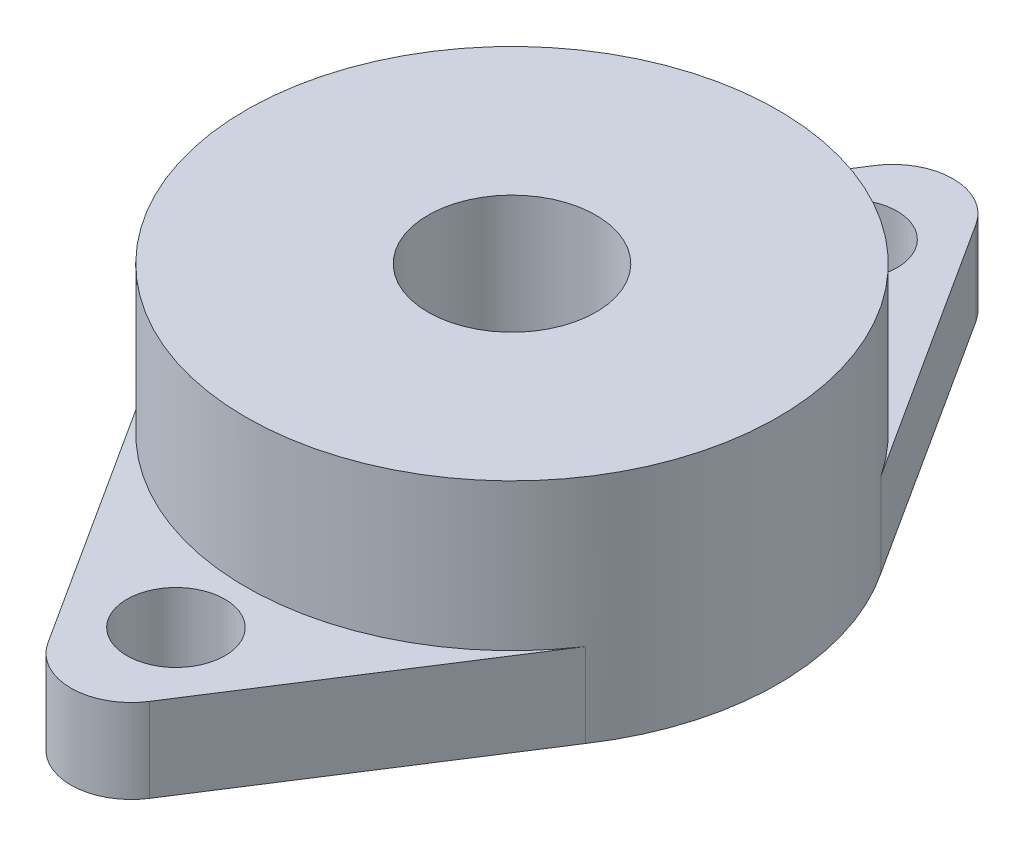
ISO-10303-21;
HEADER;
FILE_DESCRIPTION(('STEP AP214'),'2;1');
FILE_NAME('part.step','',(''),(''),'','','');
FILE_SCHEMA(('AUTOMOTIVE_DESIGN { 1 0 10303 214 1 1 1 1 }'));
ENDSEC;
DATA;
#1=APPLICATION_CONTEXT('core data for automotive mechanical design processes');
#2=APPLICATION_PROTOCOL_DEFINITION('international standard','automotive_design',2000,#1);
#3=PRODUCT_CONTEXT('',#1,'mechanical');
#4=PRODUCT('Part','Part','',(#3));
#5=PRODUCT_RELATED_PRODUCT_CATEGORY('part','',(#4));
#6=PRODUCT_DEFINITION_FORMATION('','',#4);
#7=PRODUCT_DEFINITION_CONTEXT('part definition',#1,'design');
#8=PRODUCT_DEFINITION('design','',#6,#7);
#9=PRODUCT_DEFINITION_SHAPE('','',#8);
#10=(LENGTH_UNIT() NAMED_UNIT(*) SI_UNIT(.MILLI.,.METRE.));
#11=(NAMED_UNIT(*) PLANE_ANGLE_UNIT() SI_UNIT($,.RADIAN.));
#12=(NAMED_UNIT(*) SI_UNIT($,.STERADIAN.) SOLID_ANGLE_UNIT());
#13=UNCERTAINTY_MEASURE_WITH_UNIT(LENGTH_MEASURE(1.E-05),#10,'distance_accuracy_value','');
#14=(GEOMETRIC_REPRESENTATION_CONTEXT(3) GLOBAL_UNCERTAINTY_ASSIGNED_CONTEXT((#13)) GLOBAL_UNIT_ASSIGNED_CONTEXT((#10,
#11,#12)) REPRESENTATION_CONTEXT('',''));
#15=CARTESIAN_POINT('',(0.,0.,0.));
#16=DIRECTION('',(0.,0.,1.));
#17=DIRECTION('',(1.,0.,0.));
#18=AXIS2_PLACEMENT_3D('',#15,#16,#17);
#19=CARTESIAN_POINT('',(0.,16.5,0.));
#20=DIRECTION('',(0.,-1.,0.));
#21=DIRECTION('',(0.,0.,-1.));
#22=AXIS2_PLACEMENT_3D('',#19,#20,#21);
#23=CYLINDRICAL_SURFACE('',#22,19.);
#24=CARTESIAN_POINT('',(0.,6.,0.));
#25=DIRECTION('',(0.,1.,0.));
#26=DIRECTION('',(0.,0.,1.));
#27=AXIS2_PLACEMENT_3D('',#24,#25,#26);
#28=CIRCLE('',#27,19.);
#29=CARTESIAN_POINT('',(-15.8019258783948,6.,10.5498406875989));
#30=VERTEX_POINT('',#29);
#31=CARTESIAN_POINT('',(15.801925878395,6.,10.5498406875986));
#32=VERTEX_POINT('',#31);
#33=EDGE_CURVE('E11',#30,#32,#28,.T.);
#34=ORIENTED_EDGE('',*,*,#33,.T.);
#35=DIRECTION('',(0.,-1.,0.));
#36=VECTOR('',#35,1.);
#37=CARTESIAN_POINT('',(15.8019258783948,6.,10.5498406875988));
#38=LINE('',#37,#36);
#39=CARTESIAN_POINT('',(15.8019258783948,0.,10.5498406875988));
#40=VERTEX_POINT('',#39);
#41=EDGE_CURVE('E131',#32,#40,#38,.T.);
#42=ORIENTED_EDGE('',*,*,#41,.T.);
#43=CARTESIAN_POINT('',(0.,0.,0.));
#44=DIRECTION('',(0.,1.,0.));
#45=DIRECTION('',(0.,0.,1.));
#46=AXIS2_PLACEMENT_3D('',#43,#44,#45);
#47=CIRCLE('',#46,19.);
#48=CARTESIAN_POINT('',(15.8019258783948,0.,-10.5498406875988));
#49=VERTEX_POINT('',#48);
#50=EDGE_CURVE('E173',#40,#49,#47,.T.);
#51=ORIENTED_EDGE('',*,*,#50,.T.);
#52=DIRECTION('',(0.,-1.,0.));
#53=VECTOR('',#52,1.);
#54=CARTESIAN_POINT('',(15.8019258783948,6.,-10.5498406875988));
#55=LINE('',#54,#53);
#56=CARTESIAN_POINT('',(15.8019258783948,6.,-10.5498406875988));
#57=VERTEX_POINT('',#56);
#58=EDGE_CURVE('E155',#57,#49,#55,.T.);
#59=ORIENTED_EDGE('',*,*,#58,.F.);
#60=CARTESIAN_POINT('',(0.,6.,0.));
#61=DIRECTION('',(0.,1.,0.));
#62=DIRECTION('',(0.,0.,1.));
#63=AXIS2_PLACEMENT_3D('',#60,#61,#62);
#64=CIRCLE('',#63,19.);
#65=CARTESIAN_POINT('',(-15.8019258783948,6.,-10.5498406875988));
#66=VERTEX_POINT('',#65);
#67=EDGE_CURVE('E44',#57,#66,#64,.T.);
#68=ORIENTED_EDGE('',*,*,#67,.T.);
#69=DIRECTION('',(0.,-1.,0.));
#70=VECTOR('',#69,1.);
#71=CARTESIAN_POINT('',(-15.8019258783948,6.,-10.5498406875988));
#72=LINE('',#71,#70);
#73=CARTESIAN_POINT('',(-15.8019258783948,0.,-10.5498406875988));
#74=VERTEX_POINT('',#73);
#75=EDGE_CURVE('E165',#66,#74,#72,.T.);
#76=ORIENTED_EDGE('',*,*,#75,.T.);
#77=CARTESIAN_POINT('',(-15.801925878395,0.,10.5498406875986));
#78=VERTEX_POINT('',#77);
#79=EDGE_CURVE('E177',#74,#78,#47,.T.);
#80=ORIENTED_EDGE('',*,*,#79,.T.);
#81=DIRECTION('',(0.,-1.,0.));
#82=VECTOR('',#81,1.);
#83=CARTESIAN_POINT('',(-15.8019258783948,6.,10.5498406875988));
#84=LINE('',#83,#82);
#85=EDGE_CURVE('E54',#30,#78,#84,.T.);
#86=ORIENTED_EDGE('',*,*,#85,.F.);
#87=EDGE_LOOP('',(#34,#42,#51,#59,#68,#76,#80,#86));
#88=FACE_BOUND('',#87,.T.);
#89=CARTESIAN_POINT('',(0.,16.5,0.));
#90=DIRECTION('',(0.,1.,0.));
#91=DIRECTION('',(0.,0.,1.));
#92=AXIS2_PLACEMENT_3D('',#89,#90,#91);
#93=CIRCLE('',#92,19.);
#94=CARTESIAN_POINT('',(0.,16.5,19.));
#95=VERTEX_POINT('',#94);
#96=EDGE_CURVE('E174',#95,#95,#93,.T.);
#97=ORIENTED_EDGE('',*,*,#96,.F.);
#98=EDGE_LOOP('',(#97));
#99=FACE_BOUND('',#98,.T.);
#100=ADVANCED_FACE('F37',(#88,#99),#23,.T.);
#101=CARTESIAN_POINT('',(0.,16.5,0.));
#102=DIRECTION('',(0.,1.,0.));
#103=DIRECTION('',(0.,0.,1.));
#104=AXIS2_PLACEMENT_3D('',#101,#102,#103);
#105=PLANE('',#104);
#106=CARTESIAN_POINT('',(0.,16.5,0.));
#107=DIRECTION('',(0.,1.,0.));
#108=DIRECTION('',(0.,0.,1.));
#109=AXIS2_PLACEMENT_3D('',#106,#107,#108);
#110=CIRCLE('',#109,6.);
#111=CARTESIAN_POINT('',(0.,16.5,6.));
#112=VERTEX_POINT('',#111);
#113=EDGE_CURVE('E137',#112,#112,#110,.T.);
#114=ORIENTED_EDGE('',*,*,#113,.F.);
#115=EDGE_LOOP('',(#114));
#116=FACE_BOUND('',#115,.T.);
#117=ORIENTED_EDGE('',*,*,#96,.T.);
#118=EDGE_LOOP('',(#117));
#119=FACE_BOUND('',#118,.T.);
#120=ADVANCED_FACE('F211',(#116,#119),#105,.T.);
#121=CARTESIAN_POINT('',(0.,0.,0.));
#122=DIRECTION('',(0.,1.,0.));
#123=DIRECTION('',(0.,0.,1.));
#124=AXIS2_PLACEMENT_3D('',#121,#122,#123);
#125=PLANE('',#124);
#126=CARTESIAN_POINT('',(0.,0.,24.));
#127=DIRECTION('',(0.,-1.,0.));
#128=DIRECTION('',(0.,0.,-1.));
#129=AXIS2_PLACEMENT_3D('',#126,#127,#128);
#130=CIRCLE('',#129,3.5);
#131=CARTESIAN_POINT('',(0.,0.,20.5));
#132=VERTEX_POINT('',#131);
#133=EDGE_CURVE('E126',#132,#132,#130,.T.);
#134=ORIENTED_EDGE('',*,*,#133,.F.);
#135=EDGE_LOOP('',(#134));
#136=FACE_BOUND('',#135,.T.);
#137=CARTESIAN_POINT('',(0.,0.,-24.));
#138=DIRECTION('',(0.,1.,0.));
#139=DIRECTION('',(0.,0.,1.));
#140=AXIS2_PLACEMENT_3D('',#137,#138,#139);
#141=CIRCLE('',#140,3.5);
#142=CARTESIAN_POINT('',(0.,0.,-20.5));
#143=VERTEX_POINT('',#142);
#144=EDGE_CURVE('E134',#143,#143,#141,.T.);
#145=ORIENTED_EDGE('',*,*,#144,.T.);
#146=EDGE_LOOP('',(#145));
#147=FACE_BOUND('',#146,.T.);
#148=CARTESIAN_POINT('',(0.,0.,0.));
#149=DIRECTION('',(0.,1.,0.));
#150=DIRECTION('',(0.,0.,1.));
#151=AXIS2_PLACEMENT_3D('',#148,#149,#150);
#152=CIRCLE('',#151,6.);
#153=CARTESIAN_POINT('',(0.,0.,6.));
#154=VERTEX_POINT('',#153);
#155=EDGE_CURVE('E140',#154,#154,#152,.T.);
#156=ORIENTED_EDGE('',*,*,#155,.T.);
#157=EDGE_LOOP('',(#156));
#158=FACE_BOUND('',#157,.T.);
#159=ORIENTED_EDGE('',*,*,#50,.F.);
#160=DIRECTION('',(-0.540306309271465,0.,0.841468414238733));
#161=VECTOR('',#160,1.);
#162=CARTESIAN_POINT('',(15.9853476935785,0.,10.2641811250305));
#163=LINE('',#162,#161);
#164=CARTESIAN_POINT('',(3.61947725031331,0.,29.5226817459218));
#165=VERTEX_POINT('',#164);
#166=EDGE_CURVE('E123',#40,#165,#163,.T.);
#167=ORIENTED_EDGE('',*,*,#166,.T.);
#168=CARTESIAN_POINT('',(0.,0.,27.1986178101672));
#169=DIRECTION('',(0.,-1.,0.));
#170=DIRECTION('',(0.,0.,-1.));
#171=AXIS2_PLACEMENT_3D('',#168,#169,#170);
#172=CIRCLE('',#171,4.30138218983278);
#173=CARTESIAN_POINT('',(-3.61947725031332,0.,29.5226817459218));
#174=VERTEX_POINT('',#173);
#175=EDGE_CURVE('E128',#165,#174,#172,.T.);
#176=ORIENTED_EDGE('',*,*,#175,.T.);
#177=DIRECTION('',(0.540306309271465,0.,0.841468414238733));
#178=VECTOR('',#177,1.);
#179=CARTESIAN_POINT('',(-15.9853476935785,0.,10.2641811250305));
#180=LINE('',#179,#178);
#181=EDGE_CURVE('E111',#78,#174,#180,.T.);
#182=ORIENTED_EDGE('',*,*,#181,.F.);
#183=ORIENTED_EDGE('',*,*,#79,.F.);
#184=DIRECTION('',(0.540306309271465,0.,-0.841468414238733));
#185=VECTOR('',#184,1.);
#186=CARTESIAN_POINT('',(-15.9853476935785,0.,-10.2641811250305));
#187=LINE('',#186,#185);
#188=CARTESIAN_POINT('',(-3.61947725031332,0.,-29.5226817459218));
#189=VERTEX_POINT('',#188);
#190=EDGE_CURVE('E150',#74,#189,#187,.T.);
#191=ORIENTED_EDGE('',*,*,#190,.T.);
#192=CARTESIAN_POINT('',(0.,0.,-27.1986178101672));
#193=DIRECTION('',(0.,1.,0.));
#194=DIRECTION('',(0.,0.,1.));
#195=AXIS2_PLACEMENT_3D('',#192,#193,#194);
#196=CIRCLE('',#195,4.30138218983278);
#197=CARTESIAN_POINT('',(3.61947725031331,0.,-29.5226817459218));
#198=VERTEX_POINT('',#197);
#199=EDGE_CURVE('E158',#198,#189,#196,.T.);
#200=ORIENTED_EDGE('',*,*,#199,.F.);
#201=DIRECTION('',(-0.540306309271465,0.,-0.841468414238733));
#202=VECTOR('',#201,1.);
#203=CARTESIAN_POINT('',(15.9853476935785,0.,-10.2641811250305));
#204=LINE('',#203,#202);
#205=EDGE_CURVE('E143',#49,#198,#204,.T.);
#206=ORIENTED_EDGE('',*,*,#205,.F.);
#207=EDGE_LOOP('',(#159,#167,#176,#182,#183,#191,#200,#206));
#208=FACE_BOUND('',#207,.T.);
#209=ADVANCED_FACE('F194',(#136,#147,#158,#208),#125,.F.);
#210=CARTESIAN_POINT('',(15.9853476935785,6.,-10.2641811250305));
#211=DIRECTION('',(-0.841468414238733,0.,0.540306309271465));
#212=DIRECTION('',(0.540306309271465,0.,0.841468414238733));
#213=AXIS2_PLACEMENT_3D('',#210,#211,#212);
#214=PLANE('',#213);
#215=ORIENTED_EDGE('',*,*,#205,.T.);
#216=DIRECTION('',(0.,-1.,0.));
#217=VECTOR('',#216,1.);
#218=CARTESIAN_POINT('',(3.61947725031331,6.,-29.5226817459218));
#219=LINE('',#218,#217);
#220=CARTESIAN_POINT('',(3.61947725031331,6.,-29.5226817459218));
#221=VERTEX_POINT('',#220);
#222=EDGE_CURVE('E170',#221,#198,#219,.T.);
#223=ORIENTED_EDGE('',*,*,#222,.F.);
#224=DIRECTION('',(-0.540306309271465,0.,-0.841468414238733));
#225=VECTOR('',#224,1.);
#226=CARTESIAN_POINT('',(15.9853476935785,6.,-10.2641811250305));
#227=LINE('',#226,#225);
#228=EDGE_CURVE('E146',#57,#221,#227,.T.);
#229=ORIENTED_EDGE('',*,*,#228,.F.);
#230=ORIENTED_EDGE('',*,*,#58,.T.);
#231=EDGE_LOOP('',(#215,#223,#229,#230));
#232=FACE_BOUND('',#231,.T.);
#233=ADVANCED_FACE('F210',(#232),#214,.F.);
#234=CARTESIAN_POINT('',(0.,6.,-27.1986178101672));
#235=DIRECTION('',(0.,-1.,0.));
#236=DIRECTION('',(0.,0.,-1.));
#237=AXIS2_PLACEMENT_3D('',#234,#235,#236);
#238=CYLINDRICAL_SURFACE('',#237,4.30138218983278);
#239=ORIENTED_EDGE('',*,*,#199,.T.);
#240=DIRECTION('',(0.,-1.,0.));
#241=VECTOR('',#240,1.);
#242=CARTESIAN_POINT('',(-3.61947725031332,6.,-29.5226817459218));
#243=LINE('',#242,#241);
#244=CARTESIAN_POINT('',(-3.61947725031332,6.,-29.5226817459218));
#245=VERTEX_POINT('',#244);
#246=EDGE_CURVE('E168',#245,#189,#243,.T.);
#247=ORIENTED_EDGE('',*,*,#246,.F.);
#248=CARTESIAN_POINT('',(0.,6.,-27.1986178101672));
#249=DIRECTION('',(0.,1.,0.));
#250=DIRECTION('',(0.,0.,1.));
#251=AXIS2_PLACEMENT_3D('',#248,#249,#250);
#252=CIRCLE('',#251,4.30138218983278);
#253=EDGE_CURVE('E149',#221,#245,#252,.T.);
#254=ORIENTED_EDGE('',*,*,#253,.F.);
#255=ORIENTED_EDGE('',*,*,#222,.T.);
#256=EDGE_LOOP('',(#239,#247,#254,#255));
#257=FACE_BOUND('',#256,.T.);
#258=ADVANCED_FACE('F191',(#257),#238,.T.);
#259=CARTESIAN_POINT('',(-15.9853476935785,6.,-10.2641811250305));
#260=DIRECTION('',(-0.841468414238733,0.,-0.540306309271465));
#261=DIRECTION('',(-0.540306309271465,0.,0.841468414238733));
#262=AXIS2_PLACEMENT_3D('',#259,#260,#261);
#263=PLANE('',#262);
#264=ORIENTED_EDGE('',*,*,#190,.F.);
#265=ORIENTED_EDGE('',*,*,#75,.F.);
#266=DIRECTION('',(0.540306309271465,0.,-0.841468414238733));
#267=VECTOR('',#266,1.);
#268=CARTESIAN_POINT('',(-15.9853476935785,6.,-10.2641811250305));
#269=LINE('',#268,#267);
#270=EDGE_CURVE('E152',#66,#245,#269,.T.);
#271=ORIENTED_EDGE('',*,*,#270,.T.);
#272=ORIENTED_EDGE('',*,*,#246,.T.);
#273=EDGE_LOOP('',(#264,#265,#271,#272));
#274=FACE_BOUND('',#273,.T.);
#275=ADVANCED_FACE('F186',(#274),#263,.T.);
#276=CARTESIAN_POINT('',(0.,6.,0.));
#277=DIRECTION('',(0.,1.,0.));
#278=DIRECTION('',(0.,0.,1.));
#279=AXIS2_PLACEMENT_3D('',#276,#277,#278);
#280=PLANE('',#279);
#281=CARTESIAN_POINT('',(0.,6.,-24.));
#282=DIRECTION('',(0.,1.,0.));
#283=DIRECTION('',(0.,0.,1.));
#284=AXIS2_PLACEMENT_3D('',#281,#282,#283);
#285=CIRCLE('',#284,3.5);
#286=CARTESIAN_POINT('',(0.,6.,-20.5));
#287=VERTEX_POINT('',#286);
#288=EDGE_CURVE('E133',#287,#287,#285,.T.);
#289=ORIENTED_EDGE('',*,*,#288,.F.);
#290=EDGE_LOOP('',(#289));
#291=FACE_BOUND('',#290,.T.);
#292=ORIENTED_EDGE('',*,*,#67,.F.);
#293=ORIENTED_EDGE('',*,*,#228,.T.);
#294=ORIENTED_EDGE('',*,*,#253,.T.);
#295=ORIENTED_EDGE('',*,*,#270,.F.);
#296=EDGE_LOOP('',(#292,#293,#294,#295));
#297=FACE_BOUND('',#296,.T.);
#298=ADVANCED_FACE('F187',(#291,#297),#280,.T.);
#299=CARTESIAN_POINT('',(0.,0.,0.));
#300=DIRECTION('',(0.,1.,0.));
#301=DIRECTION('',(0.,0.,1.));
#302=AXIS2_PLACEMENT_3D('',#299,#300,#301);
#303=CYLINDRICAL_SURFACE('',#302,6.);
#304=ORIENTED_EDGE('',*,*,#155,.F.);
#305=EDGE_LOOP('',(#304));
#306=FACE_BOUND('',#305,.T.);
#307=ORIENTED_EDGE('',*,*,#113,.T.);
#308=EDGE_LOOP('',(#307));
#309=FACE_BOUND('',#308,.T.);
#310=ADVANCED_FACE('F216',(#306,#309),#303,.F.);
#311=CARTESIAN_POINT('',(0.,0.,-24.));
#312=DIRECTION('',(0.,1.,0.));
#313=DIRECTION('',(0.,0.,1.));
#314=AXIS2_PLACEMENT_3D('',#311,#312,#313);
#315=CYLINDRICAL_SURFACE('',#314,3.5);
#316=ORIENTED_EDGE('',*,*,#144,.F.);
#317=EDGE_LOOP('',(#316));
#318=FACE_BOUND('',#317,.T.);
#319=ORIENTED_EDGE('',*,*,#288,.T.);
#320=EDGE_LOOP('',(#319));
#321=FACE_BOUND('',#320,.T.);
#322=ADVANCED_FACE('F219',(#318,#321),#315,.F.);
#323=CARTESIAN_POINT('',(15.9853476935785,6.,10.2641811250305));
#324=DIRECTION('',(0.841468414238733,0.,0.540306309271465));
#325=DIRECTION('',(0.540306309271465,0.,-0.841468414238733));
#326=AXIS2_PLACEMENT_3D('',#323,#324,#325);
#327=PLANE('',#326);
#328=ORIENTED_EDGE('',*,*,#166,.F.);
#329=ORIENTED_EDGE('',*,*,#41,.F.);
#330=DIRECTION('',(-0.540306309271465,0.,0.841468414238733));
#331=VECTOR('',#330,1.);
#332=CARTESIAN_POINT('',(15.9853476935785,6.,10.2641811250305));
#333=LINE('',#332,#331);
#334=CARTESIAN_POINT('',(3.61947725031331,6.,29.5226817459218));
#335=VERTEX_POINT('',#334);
#336=EDGE_CURVE('E105',#32,#335,#333,.T.);
#337=ORIENTED_EDGE('',*,*,#336,.T.);
#338=DIRECTION('',(0.,-1.,0.));
#339=VECTOR('',#338,1.);
#340=CARTESIAN_POINT('',(3.61947725031331,6.,29.5226817459218));
#341=LINE('',#340,#339);
#342=EDGE_CURVE('E115',#335,#165,#341,.T.);
#343=ORIENTED_EDGE('',*,*,#342,.T.);
#344=EDGE_LOOP('',(#328,#329,#337,#343));
#345=FACE_BOUND('',#344,.T.);
#346=ADVANCED_FACE('F197',(#345),#327,.T.);
#347=CARTESIAN_POINT('',(-15.9853476935785,6.,10.2641811250305));
#348=DIRECTION('',(0.841468414238733,0.,-0.540306309271465));
#349=DIRECTION('',(-0.540306309271465,0.,-0.841468414238733));
#350=AXIS2_PLACEMENT_3D('',#347,#348,#349);
#351=PLANE('',#350);
#352=ORIENTED_EDGE('',*,*,#181,.T.);
#353=DIRECTION('',(0.,-1.,0.));
#354=VECTOR('',#353,1.);
#355=CARTESIAN_POINT('',(-3.61947725031332,6.,29.5226817459218));
#356=LINE('',#355,#354);
#357=CARTESIAN_POINT('',(-3.61947725031332,6.,29.5226817459218));
#358=VERTEX_POINT('',#357);
#359=EDGE_CURVE('E108',#358,#174,#356,.T.);
#360=ORIENTED_EDGE('',*,*,#359,.F.);
#361=DIRECTION('',(0.540306309271465,0.,0.841468414238733));
#362=VECTOR('',#361,1.);
#363=CARTESIAN_POINT('',(-15.9853476935785,6.,10.2641811250305));
#364=LINE('',#363,#362);
#365=EDGE_CURVE('E98',#30,#358,#364,.T.);
#366=ORIENTED_EDGE('',*,*,#365,.F.);
#367=ORIENTED_EDGE('',*,*,#85,.T.);
#368=EDGE_LOOP('',(#352,#360,#366,#367));
#369=FACE_BOUND('',#368,.T.);
#370=ADVANCED_FACE('F109',(#369),#351,.F.);
#371=CARTESIAN_POINT('',(0.,6.,27.1986178101672));
#372=DIRECTION('',(0.,-1.,0.));
#373=DIRECTION('',(0.,0.,-1.));
#374=AXIS2_PLACEMENT_3D('',#371,#372,#373);
#375=CYLINDRICAL_SURFACE('',#374,4.30138218983278);
#376=ORIENTED_EDGE('',*,*,#175,.F.);
#377=ORIENTED_EDGE('',*,*,#342,.F.);
#378=CARTESIAN_POINT('',(0.,6.,27.1986178101672));
#379=DIRECTION('',(0.,-1.,0.));
#380=DIRECTION('',(0.,0.,-1.));
#381=AXIS2_PLACEMENT_3D('',#378,#379,#380);
#382=CIRCLE('',#381,4.30138218983278);
#383=EDGE_CURVE('E103',#335,#358,#382,.T.);
#384=ORIENTED_EDGE('',*,*,#383,.T.);
#385=ORIENTED_EDGE('',*,*,#359,.T.);
#386=EDGE_LOOP('',(#376,#377,#384,#385));
#387=FACE_BOUND('',#386,.T.);
#388=ADVANCED_FACE('F117',(#387),#375,.T.);
#389=CARTESIAN_POINT('',(0.,6.,0.));
#390=DIRECTION('',(0.,1.,0.));
#391=DIRECTION('',(0.,0.,-1.));
#392=AXIS2_PLACEMENT_3D('',#389,#390,#391);
#393=PLANE('',#392);
#394=CARTESIAN_POINT('',(0.,6.,24.));
#395=DIRECTION('',(0.,-1.,0.));
#396=DIRECTION('',(0.,0.,-1.));
#397=AXIS2_PLACEMENT_3D('',#394,#395,#396);
#398=CIRCLE('',#397,3.5);
#399=CARTESIAN_POINT('',(0.,6.,20.5));
#400=VERTEX_POINT('',#399);
#401=EDGE_CURVE('E199',#400,#400,#398,.T.);
#402=ORIENTED_EDGE('',*,*,#401,.T.);
#403=EDGE_LOOP('',(#402));
#404=FACE_BOUND('',#403,.T.);
#405=ORIENTED_EDGE('',*,*,#33,.F.);
#406=ORIENTED_EDGE('',*,*,#365,.T.);
#407=ORIENTED_EDGE('',*,*,#383,.F.);
#408=ORIENTED_EDGE('',*,*,#336,.F.);
#409=EDGE_LOOP('',(#405,#406,#407,#408));
#410=FACE_BOUND('',#409,.T.);
#411=ADVANCED_FACE('F100',(#404,#410),#393,.T.);
#412=CARTESIAN_POINT('',(0.,0.,24.));
#413=DIRECTION('',(0.,1.,0.));
#414=DIRECTION('',(0.,0.,1.));
#415=AXIS2_PLACEMENT_3D('',#412,#413,#414);
#416=CYLINDRICAL_SURFACE('',#415,3.5);
#417=ORIENTED_EDGE('',*,*,#133,.T.);
#418=EDGE_LOOP('',(#417));
#419=FACE_BOUND('',#418,.T.);
#420=ORIENTED_EDGE('',*,*,#401,.F.);
#421=EDGE_LOOP('',(#420));
#422=FACE_BOUND('',#421,.T.);
#423=ADVANCED_FACE('F205',(#419,#422),#416,.F.);
#424=CLOSED_SHELL('',(#100,#120,#209,#233,#258,#275,#298,#310,#322,#346,#370,#388,#411,#423));
#425=MANIFOLD_SOLID_BREP('B2',#424);
#426=ADVANCED_BREP_SHAPE_REPRESENTATION('',(#18,#425),#14);
#427=SHAPE_DEFINITION_REPRESENTATION(#9,#426);
ENDSEC;
END-ISO-10303-21;
